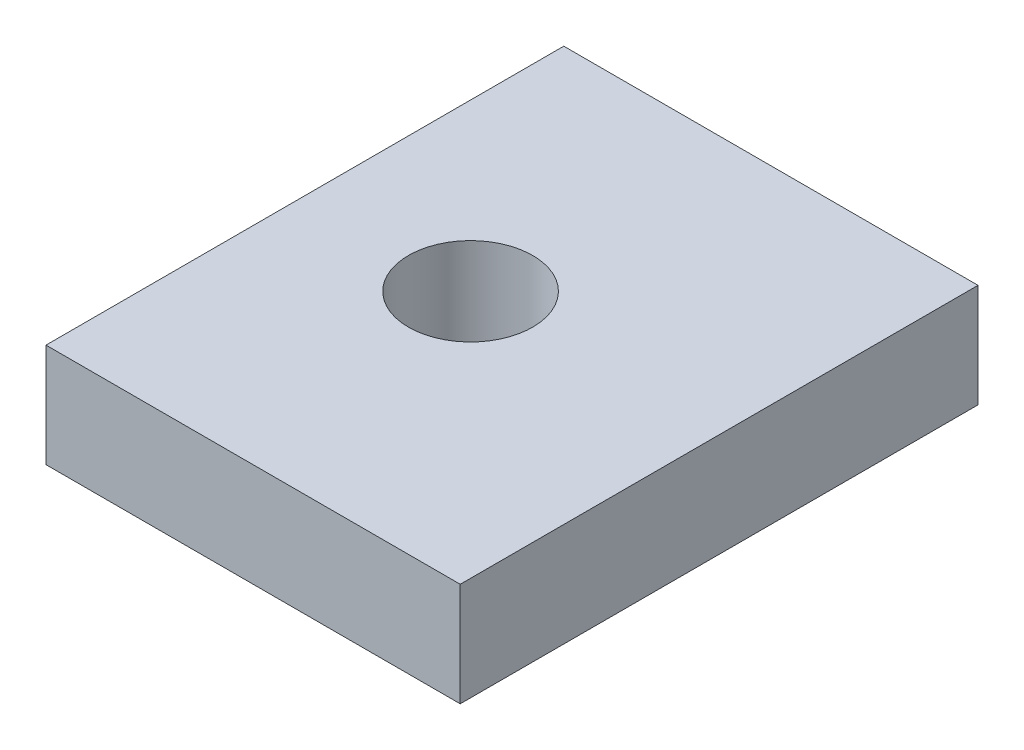
ISO-10303-21;
HEADER;
FILE_DESCRIPTION(('STEP AP214'),'2;1');
FILE_NAME('part.step','',(''),(''),'','','');
FILE_SCHEMA(('AUTOMOTIVE_DESIGN { 1 0 10303 214 1 1 1 1 }'));
ENDSEC;
DATA;
#1=APPLICATION_CONTEXT('core data for automotive mechanical design processes');
#2=APPLICATION_PROTOCOL_DEFINITION('international standard','automotive_design',2000,#1);
#3=PRODUCT_CONTEXT('',#1,'mechanical');
#4=PRODUCT('Part','Part','',(#3));
#5=PRODUCT_RELATED_PRODUCT_CATEGORY('part','',(#4));
#6=PRODUCT_DEFINITION_FORMATION('','',#4);
#7=PRODUCT_DEFINITION_CONTEXT('part definition',#1,'design');
#8=PRODUCT_DEFINITION('design','',#6,#7);
#9=PRODUCT_DEFINITION_SHAPE('','',#8);
#10=(LENGTH_UNIT() NAMED_UNIT(*) SI_UNIT(.MILLI.,.METRE.));
#11=(NAMED_UNIT(*) PLANE_ANGLE_UNIT() SI_UNIT($,.RADIAN.));
#12=(NAMED_UNIT(*) SI_UNIT($,.STERADIAN.) SOLID_ANGLE_UNIT());
#13=UNCERTAINTY_MEASURE_WITH_UNIT(LENGTH_MEASURE(1.E-05),#10,'distance_accuracy_value','');
#14=(GEOMETRIC_REPRESENTATION_CONTEXT(3) GLOBAL_UNCERTAINTY_ASSIGNED_CONTEXT((#13)) GLOBAL_UNIT_ASSIGNED_CONTEXT((#10,
#11,#12)) REPRESENTATION_CONTEXT('',''));
#15=CARTESIAN_POINT('',(0.,0.,0.));
#16=DIRECTION('',(0.,0.,1.));
#17=DIRECTION('',(1.,0.,0.));
#18=AXIS2_PLACEMENT_3D('',#15,#16,#17);
#19=CARTESIAN_POINT('',(0.,0.,25.));
#20=DIRECTION('',(1.,0.,0.));
#21=DIRECTION('',(0.,1.,0.));
#22=AXIS2_PLACEMENT_3D('',#19,#20,#21);
#23=PLANE('',#22);
#24=DIRECTION('',(0.,-1.,0.));
#25=VECTOR('',#24,1.);
#26=CARTESIAN_POINT('',(0.,0.,0.));
#27=LINE('',#26,#25);
#28=CARTESIAN_POINT('',(0.,0.,0.));
#29=VERTEX_POINT('',#28);
#30=CARTESIAN_POINT('',(0.,-5.,0.));
#31=VERTEX_POINT('',#30);
#32=EDGE_CURVE('E99',#29,#31,#27,.T.);
#33=ORIENTED_EDGE('',*,*,#32,.T.);
#34=DIRECTION('',(0.,0.,-1.));
#35=VECTOR('',#34,1.);
#36=CARTESIAN_POINT('',(0.,-5.,25.));
#37=LINE('',#36,#35);
#38=CARTESIAN_POINT('',(0.,-5.,25.));
#39=VERTEX_POINT('',#38);
#40=EDGE_CURVE('E11',#39,#31,#37,.T.);
#41=ORIENTED_EDGE('',*,*,#40,.F.);
#42=DIRECTION('',(0.,-1.,0.));
#43=VECTOR('',#42,1.);
#44=CARTESIAN_POINT('',(0.,0.,25.));
#45=LINE('',#44,#43);
#46=CARTESIAN_POINT('',(0.,0.,25.));
#47=VERTEX_POINT('',#46);
#48=EDGE_CURVE('E87',#47,#39,#45,.T.);
#49=ORIENTED_EDGE('',*,*,#48,.F.);
#50=DIRECTION('',(0.,0.,-1.));
#51=VECTOR('',#50,1.);
#52=CARTESIAN_POINT('',(0.,0.,25.));
#53=LINE('',#52,#51);
#54=EDGE_CURVE('E95',#47,#29,#53,.T.);
#55=ORIENTED_EDGE('',*,*,#54,.T.);
#56=EDGE_LOOP('',(#33,#41,#49,#55));
#57=FACE_BOUND('',#56,.T.);
#58=ADVANCED_FACE('F36',(#57),#23,.F.);
#59=CARTESIAN_POINT('',(0.,-5.,25.));
#60=DIRECTION('',(0.,1.,0.));
#61=DIRECTION('',(0.,0.,1.));
#62=AXIS2_PLACEMENT_3D('',#59,#60,#61);
#63=PLANE('',#62);
#64=CARTESIAN_POINT('',(8.,-5.,12.5));
#65=DIRECTION('',(0.,1.,0.));
#66=DIRECTION('',(0.,0.,1.));
#67=AXIS2_PLACEMENT_3D('',#64,#65,#66);
#68=CIRCLE('',#67,3.);
#69=CARTESIAN_POINT('',(8.,-5.,15.5));
#70=VERTEX_POINT('',#69);
#71=EDGE_CURVE('E102',#70,#70,#68,.T.);
#72=ORIENTED_EDGE('',*,*,#71,.T.);
#73=EDGE_LOOP('',(#72));
#74=FACE_BOUND('',#73,.T.);
#75=DIRECTION('',(1.,0.,0.));
#76=VECTOR('',#75,1.);
#77=CARTESIAN_POINT('',(0.,-5.,0.));
#78=LINE('',#77,#76);
#79=CARTESIAN_POINT('',(20.,-5.,0.));
#80=VERTEX_POINT('',#79);
#81=EDGE_CURVE('E91',#31,#80,#78,.T.);
#82=ORIENTED_EDGE('',*,*,#81,.T.);
#83=DIRECTION('',(0.,0.,-1.));
#84=VECTOR('',#83,1.);
#85=CARTESIAN_POINT('',(20.,-5.,25.));
#86=LINE('',#85,#84);
#87=CARTESIAN_POINT('',(20.,-5.,25.));
#88=VERTEX_POINT('',#87);
#89=EDGE_CURVE('E44',#88,#80,#86,.T.);
#90=ORIENTED_EDGE('',*,*,#89,.F.);
#91=DIRECTION('',(1.,0.,0.));
#92=VECTOR('',#91,1.);
#93=CARTESIAN_POINT('',(0.,-5.,25.));
#94=LINE('',#93,#92);
#95=EDGE_CURVE('E82',#39,#88,#94,.T.);
#96=ORIENTED_EDGE('',*,*,#95,.F.);
#97=ORIENTED_EDGE('',*,*,#40,.T.);
#98=EDGE_LOOP('',(#82,#90,#96,#97));
#99=FACE_BOUND('',#98,.T.);
#100=ADVANCED_FACE('F90',(#74,#99),#63,.F.);
#101=CARTESIAN_POINT('',(20.,0.,25.));
#102=DIRECTION('',(-1.,0.,0.));
#103=DIRECTION('',(0.,0.,1.));
#104=AXIS2_PLACEMENT_3D('',#101,#102,#103);
#105=PLANE('',#104);
#106=DIRECTION('',(0.,1.,0.));
#107=VECTOR('',#106,1.);
#108=CARTESIAN_POINT('',(20.,0.,0.));
#109=LINE('',#108,#107);
#110=CARTESIAN_POINT('',(20.,0.,0.));
#111=VERTEX_POINT('',#110);
#112=EDGE_CURVE('E69',#80,#111,#109,.T.);
#113=ORIENTED_EDGE('',*,*,#112,.T.);
#114=DIRECTION('',(0.,0.,-1.));
#115=VECTOR('',#114,1.);
#116=CARTESIAN_POINT('',(20.,0.,25.));
#117=LINE('',#116,#115);
#118=CARTESIAN_POINT('',(20.,0.,25.));
#119=VERTEX_POINT('',#118);
#120=EDGE_CURVE('E92',#119,#111,#117,.T.);
#121=ORIENTED_EDGE('',*,*,#120,.F.);
#122=DIRECTION('',(0.,1.,0.));
#123=VECTOR('',#122,1.);
#124=CARTESIAN_POINT('',(20.,0.,25.));
#125=LINE('',#124,#123);
#126=EDGE_CURVE('E85',#88,#119,#125,.T.);
#127=ORIENTED_EDGE('',*,*,#126,.F.);
#128=ORIENTED_EDGE('',*,*,#89,.T.);
#129=EDGE_LOOP('',(#113,#121,#127,#128));
#130=FACE_BOUND('',#129,.T.);
#131=ADVANCED_FACE('F93',(#130),#105,.F.);
#132=CARTESIAN_POINT('',(0.,0.,25.));
#133=DIRECTION('',(0.,-1.,0.));
#134=DIRECTION('',(0.,0.,-1.));
#135=AXIS2_PLACEMENT_3D('',#132,#133,#134);
#136=PLANE('',#135);
#137=CARTESIAN_POINT('',(8.,0.,12.5));
#138=DIRECTION('',(0.,1.,0.));
#139=DIRECTION('',(0.,0.,1.));
#140=AXIS2_PLACEMENT_3D('',#137,#138,#139);
#141=CIRCLE('',#140,3.);
#142=CARTESIAN_POINT('',(8.,0.,15.5));
#143=VERTEX_POINT('',#142);
#144=EDGE_CURVE('E113',#143,#143,#141,.T.);
#145=ORIENTED_EDGE('',*,*,#144,.F.);
#146=EDGE_LOOP('',(#145));
#147=FACE_BOUND('',#146,.T.);
#148=DIRECTION('',(-1.,0.,0.));
#149=VECTOR('',#148,1.);
#150=CARTESIAN_POINT('',(0.,0.,0.));
#151=LINE('',#150,#149);
#152=EDGE_CURVE('E75',#111,#29,#151,.T.);
#153=ORIENTED_EDGE('',*,*,#152,.T.);
#154=ORIENTED_EDGE('',*,*,#54,.F.);
#155=DIRECTION('',(-1.,0.,0.));
#156=VECTOR('',#155,1.);
#157=CARTESIAN_POINT('',(0.,0.,25.));
#158=LINE('',#157,#156);
#159=EDGE_CURVE('E52',#119,#47,#158,.T.);
#160=ORIENTED_EDGE('',*,*,#159,.F.);
#161=ORIENTED_EDGE('',*,*,#120,.T.);
#162=EDGE_LOOP('',(#153,#154,#160,#161));
#163=FACE_BOUND('',#162,.T.);
#164=ADVANCED_FACE('F107',(#147,#163),#136,.F.);
#165=CARTESIAN_POINT('',(0.,0.,25.));
#166=DIRECTION('',(0.,0.,1.));
#167=DIRECTION('',(1.,0.,0.));
#168=AXIS2_PLACEMENT_3D('',#165,#166,#167);
#169=PLANE('',#168);
#170=ORIENTED_EDGE('',*,*,#48,.T.);
#171=ORIENTED_EDGE('',*,*,#95,.T.);
#172=ORIENTED_EDGE('',*,*,#126,.T.);
#173=ORIENTED_EDGE('',*,*,#159,.T.);
#174=EDGE_LOOP('',(#170,#171,#172,#173));
#175=FACE_BOUND('',#174,.T.);
#176=ADVANCED_FACE('F83',(#175),#169,.T.);
#177=CARTESIAN_POINT('',(0.,0.,0.));
#178=DIRECTION('',(0.,0.,1.));
#179=DIRECTION('',(1.,0.,0.));
#180=AXIS2_PLACEMENT_3D('',#177,#178,#179);
#181=PLANE('',#180);
#182=ORIENTED_EDGE('',*,*,#32,.F.);
#183=ORIENTED_EDGE('',*,*,#152,.F.);
#184=ORIENTED_EDGE('',*,*,#112,.F.);
#185=ORIENTED_EDGE('',*,*,#81,.F.);
#186=EDGE_LOOP('',(#182,#183,#184,#185));
#187=FACE_BOUND('',#186,.T.);
#188=ADVANCED_FACE('F110',(#187),#181,.F.);
#189=CARTESIAN_POINT('',(8.,-5.,12.5));
#190=DIRECTION('',(0.,1.,0.));
#191=DIRECTION('',(0.,0.,1.));
#192=AXIS2_PLACEMENT_3D('',#189,#190,#191);
#193=CYLINDRICAL_SURFACE('',#192,3.);
#194=ORIENTED_EDGE('',*,*,#71,.F.);
#195=EDGE_LOOP('',(#194));
#196=FACE_BOUND('',#195,.T.);
#197=ORIENTED_EDGE('',*,*,#144,.T.);
#198=EDGE_LOOP('',(#197));
#199=FACE_BOUND('',#198,.T.);
#200=ADVANCED_FACE('F120',(#196,#199),#193,.F.);
#201=CLOSED_SHELL('',(#58,#100,#131,#164,#176,#188,#200));
#202=MANIFOLD_SOLID_BREP('B2',#201);
#203=ADVANCED_BREP_SHAPE_REPRESENTATION('',(#18,#202),#14);
#204=SHAPE_DEFINITION_REPRESENTATION(#9,#203);
ENDSEC;
END-ISO-10303-21;
